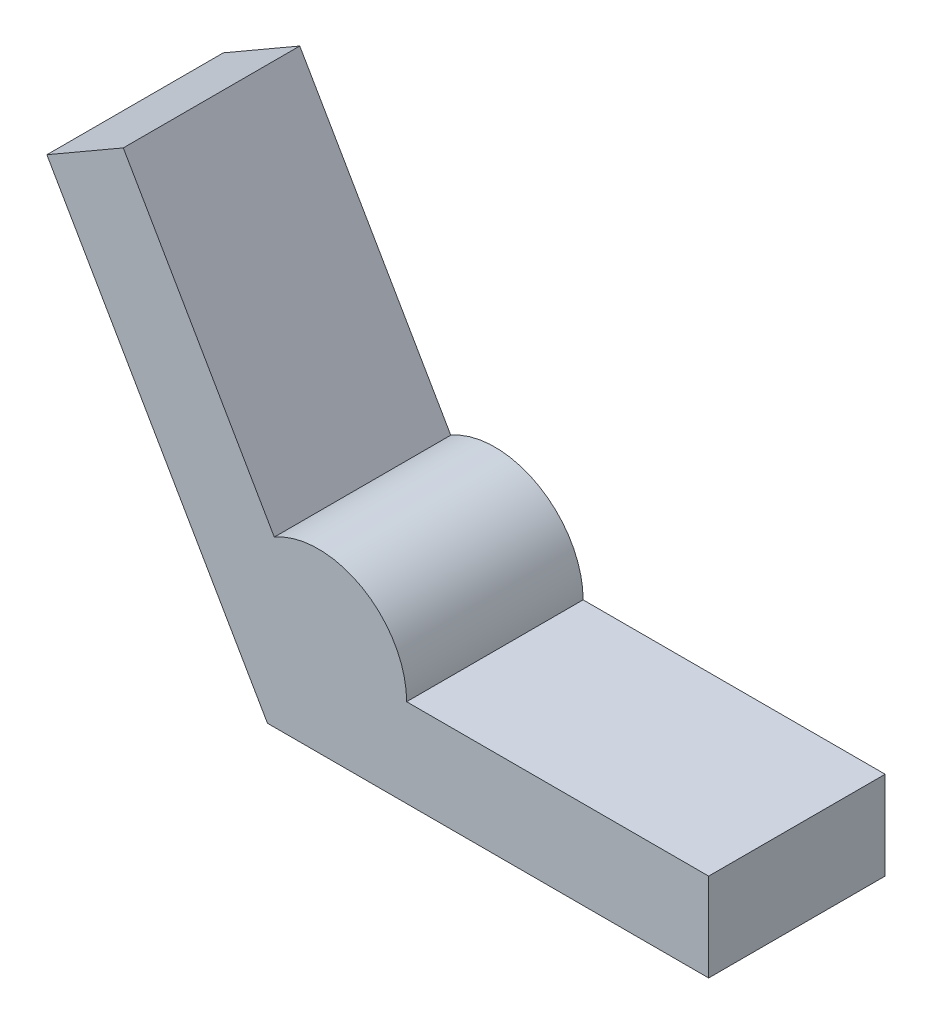
ISO-10303-21;
HEADER;
FILE_DESCRIPTION(('STEP AP214'),'2;1');
FILE_NAME('part.step','',(''),(''),'','','');
FILE_SCHEMA(('AUTOMOTIVE_DESIGN { 1 0 10303 214 1 1 1 1 }'));
ENDSEC;
DATA;
#1=APPLICATION_CONTEXT('core data for automotive mechanical design processes');
#2=APPLICATION_PROTOCOL_DEFINITION('international standard','automotive_design',2000,#1);
#3=PRODUCT_CONTEXT('',#1,'mechanical');
#4=PRODUCT('Part','Part','',(#3));
#5=PRODUCT_RELATED_PRODUCT_CATEGORY('part','',(#4));
#6=PRODUCT_DEFINITION_FORMATION('','',#4);
#7=PRODUCT_DEFINITION_CONTEXT('part definition',#1,'design');
#8=PRODUCT_DEFINITION('design','',#6,#7);
#9=PRODUCT_DEFINITION_SHAPE('','',#8);
#10=(LENGTH_UNIT() NAMED_UNIT(*) SI_UNIT(.MILLI.,.METRE.));
#11=(NAMED_UNIT(*) PLANE_ANGLE_UNIT() SI_UNIT($,.RADIAN.));
#12=(NAMED_UNIT(*) SI_UNIT($,.STERADIAN.) SOLID_ANGLE_UNIT());
#13=UNCERTAINTY_MEASURE_WITH_UNIT(LENGTH_MEASURE(1.E-05),#10,'distance_accuracy_value','');
#14=(GEOMETRIC_REPRESENTATION_CONTEXT(3) GLOBAL_UNCERTAINTY_ASSIGNED_CONTEXT((#13)) GLOBAL_UNIT_ASSIGNED_CONTEXT((#10,
#11,#12)) REPRESENTATION_CONTEXT('',''));
#15=CARTESIAN_POINT('',(0.,0.,0.));
#16=DIRECTION('',(0.,0.,1.));
#17=DIRECTION('',(1.,0.,0.));
#18=AXIS2_PLACEMENT_3D('',#15,#16,#17);
#19=CARTESIAN_POINT('',(-7.49999999999997,12.9903810567666,6.));
#20=DIRECTION('',(0.86602540378444,0.499999999999998,0.));
#21=DIRECTION('',(-0.499999999999998,0.86602540378444,0.));
#22=AXIS2_PLACEMENT_3D('',#19,#20,#21);
#23=PLANE('',#22);
#24=DIRECTION('',(0.499999999999998,-0.86602540378444,0.));
#25=VECTOR('',#24,1.);
#26=CARTESIAN_POINT('',(-7.49999999999997,12.9903810567666,0.));
#27=LINE('',#26,#25);
#28=CARTESIAN_POINT('',(-7.49999999999997,12.9903810567666,0.));
#29=VERTEX_POINT('',#28);
#30=CARTESIAN_POINT('',(0.,0.,0.));
#31=VERTEX_POINT('',#30);
#32=EDGE_CURVE('E134',#29,#31,#27,.T.);
#33=ORIENTED_EDGE('',*,*,#32,.T.);
#34=DIRECTION('',(0.,0.,-1.));
#35=VECTOR('',#34,1.);
#36=CARTESIAN_POINT('',(0.,0.,6.));
#37=LINE('',#36,#35);
#38=CARTESIAN_POINT('',(0.,0.,6.));
#39=VERTEX_POINT('',#38);
#40=EDGE_CURVE('E11',#39,#31,#37,.T.);
#41=ORIENTED_EDGE('',*,*,#40,.F.);
#42=DIRECTION('',(0.499999999999998,-0.86602540378444,0.));
#43=VECTOR('',#42,1.);
#44=CARTESIAN_POINT('',(-7.49999999999997,12.9903810567666,6.));
#45=LINE('',#44,#43);
#46=CARTESIAN_POINT('',(-7.49999999999997,12.9903810567666,6.));
#47=VERTEX_POINT('',#46);
#48=EDGE_CURVE('E153',#47,#39,#45,.T.);
#49=ORIENTED_EDGE('',*,*,#48,.F.);
#50=DIRECTION('',(0.,0.,-1.));
#51=VECTOR('',#50,1.);
#52=CARTESIAN_POINT('',(-7.49999999999997,12.9903810567666,6.));
#53=LINE('',#52,#51);
#54=EDGE_CURVE('E130',#47,#29,#53,.T.);
#55=ORIENTED_EDGE('',*,*,#54,.T.);
#56=EDGE_LOOP('',(#33,#41,#49,#55));
#57=FACE_BOUND('',#56,.T.);
#58=ADVANCED_FACE('F39',(#57),#23,.F.);
#59=CARTESIAN_POINT('',(0.,0.,6.));
#60=DIRECTION('',(0.,1.,0.));
#61=DIRECTION('',(0.,0.,1.));
#62=AXIS2_PLACEMENT_3D('',#59,#60,#61);
#63=PLANE('',#62);
#64=DIRECTION('',(1.,0.,0.));
#65=VECTOR('',#64,1.);
#66=CARTESIAN_POINT('',(0.,0.,0.));
#67=LINE('',#66,#65);
#68=CARTESIAN_POINT('',(15.,0.,0.));
#69=VERTEX_POINT('',#68);
#70=EDGE_CURVE('E138',#31,#69,#67,.T.);
#71=ORIENTED_EDGE('',*,*,#70,.T.);
#72=DIRECTION('',(0.,0.,-1.));
#73=VECTOR('',#72,1.);
#74=CARTESIAN_POINT('',(15.,0.,6.));
#75=LINE('',#74,#73);
#76=CARTESIAN_POINT('',(15.,0.,6.));
#77=VERTEX_POINT('',#76);
#78=EDGE_CURVE('E48',#77,#69,#75,.T.);
#79=ORIENTED_EDGE('',*,*,#78,.F.);
#80=DIRECTION('',(1.,0.,0.));
#81=VECTOR('',#80,1.);
#82=CARTESIAN_POINT('',(0.,0.,6.));
#83=LINE('',#82,#81);
#84=EDGE_CURVE('E96',#39,#77,#83,.T.);
#85=ORIENTED_EDGE('',*,*,#84,.F.);
#86=ORIENTED_EDGE('',*,*,#40,.T.);
#87=EDGE_LOOP('',(#71,#79,#85,#86));
#88=FACE_BOUND('',#87,.T.);
#89=ADVANCED_FACE('F187',(#88),#63,.F.);
#90=CARTESIAN_POINT('',(15.,0.,6.));
#91=DIRECTION('',(-1.,0.,0.));
#92=DIRECTION('',(0.,0.,1.));
#93=AXIS2_PLACEMENT_3D('',#90,#91,#92);
#94=PLANE('',#93);
#95=DIRECTION('',(0.,1.,0.));
#96=VECTOR('',#95,1.);
#97=CARTESIAN_POINT('',(15.,0.,0.));
#98=LINE('',#97,#96);
#99=CARTESIAN_POINT('',(15.,3.,0.));
#100=VERTEX_POINT('',#99);
#101=EDGE_CURVE('E141',#69,#100,#98,.T.);
#102=ORIENTED_EDGE('',*,*,#101,.T.);
#103=DIRECTION('',(0.,0.,-1.));
#104=VECTOR('',#103,1.);
#105=CARTESIAN_POINT('',(15.,3.,6.));
#106=LINE('',#105,#104);
#107=CARTESIAN_POINT('',(15.,3.,6.));
#108=VERTEX_POINT('',#107);
#109=EDGE_CURVE('E160',#108,#100,#106,.T.);
#110=ORIENTED_EDGE('',*,*,#109,.F.);
#111=DIRECTION('',(0.,1.,0.));
#112=VECTOR('',#111,1.);
#113=CARTESIAN_POINT('',(15.,0.,6.));
#114=LINE('',#113,#112);
#115=EDGE_CURVE('E170',#77,#108,#114,.T.);
#116=ORIENTED_EDGE('',*,*,#115,.F.);
#117=ORIENTED_EDGE('',*,*,#78,.T.);
#118=EDGE_LOOP('',(#102,#110,#116,#117));
#119=FACE_BOUND('',#118,.T.);
#120=ADVANCED_FACE('F168',(#119),#94,.F.);
#121=CARTESIAN_POINT('',(15.,3.,6.));
#122=DIRECTION('',(0.,-1.,0.));
#123=DIRECTION('',(1.,0.,0.));
#124=AXIS2_PLACEMENT_3D('',#121,#122,#123);
#125=PLANE('',#124);
#126=DIRECTION('',(-1.,0.,0.));
#127=VECTOR('',#126,1.);
#128=CARTESIAN_POINT('',(15.,3.,0.));
#129=LINE('',#128,#127);
#130=CARTESIAN_POINT('',(4.73205080756889,3.,0.));
#131=VERTEX_POINT('',#130);
#132=EDGE_CURVE('E144',#100,#131,#129,.T.);
#133=ORIENTED_EDGE('',*,*,#132,.T.);
#134=DIRECTION('',(0.,0.,-1.));
#135=VECTOR('',#134,1.);
#136=CARTESIAN_POINT('',(4.73205080756889,3.,6.));
#137=LINE('',#136,#135);
#138=CARTESIAN_POINT('',(4.73205080756889,3.,6.));
#139=VERTEX_POINT('',#138);
#140=EDGE_CURVE('E123',#139,#131,#137,.T.);
#141=ORIENTED_EDGE('',*,*,#140,.F.);
#142=DIRECTION('',(-1.,0.,0.));
#143=VECTOR('',#142,1.);
#144=CARTESIAN_POINT('',(15.,3.,6.));
#145=LINE('',#144,#143);
#146=EDGE_CURVE('E112',#108,#139,#145,.T.);
#147=ORIENTED_EDGE('',*,*,#146,.F.);
#148=ORIENTED_EDGE('',*,*,#109,.T.);
#149=EDGE_LOOP('',(#133,#141,#147,#148));
#150=FACE_BOUND('',#149,.T.);
#151=ADVANCED_FACE('F176',(#150),#125,.F.);
#152=CARTESIAN_POINT('',(1.73205080756889,3.,6.));
#153=DIRECTION('',(0.,0.,-1.));
#154=DIRECTION('',(-1.,0.,0.));
#155=AXIS2_PLACEMENT_3D('',#152,#153,#154);
#156=CYLINDRICAL_SURFACE('',#155,3.);
#157=CARTESIAN_POINT('',(1.73205080756889,3.,0.));
#158=DIRECTION('',(0.,0.,1.));
#159=DIRECTION('',(1.,0.,0.));
#160=AXIS2_PLACEMENT_3D('',#157,#158,#159);
#161=CIRCLE('',#160,3.);
#162=CARTESIAN_POINT('',(0.232050807568891,5.59807621135332,0.));
#163=VERTEX_POINT('',#162);
#164=EDGE_CURVE('E121',#131,#163,#161,.T.);
#165=ORIENTED_EDGE('',*,*,#164,.T.);
#166=DIRECTION('',(0.,0.,-1.));
#167=VECTOR('',#166,1.);
#168=CARTESIAN_POINT('',(0.232050807568891,5.59807621135332,6.));
#169=LINE('',#168,#167);
#170=CARTESIAN_POINT('',(0.232050807568891,5.59807621135332,6.));
#171=VERTEX_POINT('',#170);
#172=EDGE_CURVE('E118',#171,#163,#169,.T.);
#173=ORIENTED_EDGE('',*,*,#172,.F.);
#174=CARTESIAN_POINT('',(1.73205080756889,3.,6.));
#175=DIRECTION('',(0.,0.,1.));
#176=DIRECTION('',(1.,0.,0.));
#177=AXIS2_PLACEMENT_3D('',#174,#175,#176);
#178=CIRCLE('',#177,3.);
#179=EDGE_CURVE('E106',#139,#171,#178,.T.);
#180=ORIENTED_EDGE('',*,*,#179,.F.);
#181=ORIENTED_EDGE('',*,*,#140,.T.);
#182=EDGE_LOOP('',(#165,#173,#180,#181));
#183=FACE_BOUND('',#182,.T.);
#184=ADVANCED_FACE('F119',(#183),#156,.T.);
#185=CARTESIAN_POINT('',(0.232050807568891,5.59807621135332,6.));
#186=DIRECTION('',(-0.86602540378444,-0.499999999999998,0.));
#187=DIRECTION('',(0.499999999999998,-0.86602540378444,0.));
#188=AXIS2_PLACEMENT_3D('',#185,#186,#187);
#189=PLANE('',#188);
#190=DIRECTION('',(-0.499999999999998,0.86602540378444,0.));
#191=VECTOR('',#190,1.);
#192=CARTESIAN_POINT('',(0.232050807568891,5.59807621135332,0.));
#193=LINE('',#192,#191);
#194=CARTESIAN_POINT('',(-4.90192378864665,14.4903810567666,0.));
#195=VERTEX_POINT('',#194);
#196=EDGE_CURVE('E82',#163,#195,#193,.T.);
#197=ORIENTED_EDGE('',*,*,#196,.T.);
#198=DIRECTION('',(0.,0.,-1.));
#199=VECTOR('',#198,1.);
#200=CARTESIAN_POINT('',(-4.90192378864665,14.4903810567666,6.));
#201=LINE('',#200,#199);
#202=CARTESIAN_POINT('',(-4.90192378864665,14.4903810567666,6.));
#203=VERTEX_POINT('',#202);
#204=EDGE_CURVE('E124',#203,#195,#201,.T.);
#205=ORIENTED_EDGE('',*,*,#204,.F.);
#206=DIRECTION('',(-0.499999999999998,0.86602540378444,0.));
#207=VECTOR('',#206,1.);
#208=CARTESIAN_POINT('',(0.232050807568891,5.59807621135332,6.));
#209=LINE('',#208,#207);
#210=EDGE_CURVE('E110',#171,#203,#209,.T.);
#211=ORIENTED_EDGE('',*,*,#210,.F.);
#212=ORIENTED_EDGE('',*,*,#172,.T.);
#213=EDGE_LOOP('',(#197,#205,#211,#212));
#214=FACE_BOUND('',#213,.T.);
#215=ADVANCED_FACE('F126',(#214),#189,.F.);
#216=CARTESIAN_POINT('',(-4.90192378864665,14.4903810567666,6.));
#217=DIRECTION('',(0.499999999999998,-0.86602540378444,0.));
#218=DIRECTION('',(0.86602540378444,0.499999999999998,0.));
#219=AXIS2_PLACEMENT_3D('',#216,#217,#218);
#220=PLANE('',#219);
#221=DIRECTION('',(-0.86602540378444,-0.499999999999998,0.));
#222=VECTOR('',#221,1.);
#223=CARTESIAN_POINT('',(-4.90192378864665,14.4903810567666,0.));
#224=LINE('',#223,#222);
#225=EDGE_CURVE('E88',#195,#29,#224,.T.);
#226=ORIENTED_EDGE('',*,*,#225,.T.);
#227=ORIENTED_EDGE('',*,*,#54,.F.);
#228=DIRECTION('',(-0.86602540378444,-0.499999999999998,0.));
#229=VECTOR('',#228,1.);
#230=CARTESIAN_POINT('',(-4.90192378864665,14.4903810567666,6.));
#231=LINE('',#230,#229);
#232=EDGE_CURVE('E56',#203,#47,#231,.T.);
#233=ORIENTED_EDGE('',*,*,#232,.F.);
#234=ORIENTED_EDGE('',*,*,#204,.T.);
#235=EDGE_LOOP('',(#226,#227,#233,#234));
#236=FACE_BOUND('',#235,.T.);
#237=ADVANCED_FACE('F201',(#236),#220,.F.);
#238=CARTESIAN_POINT('',(1.73205080756889,3.,6.));
#239=DIRECTION('',(0.,0.,1.));
#240=DIRECTION('',(1.,0.,0.));
#241=AXIS2_PLACEMENT_3D('',#238,#239,#240);
#242=PLANE('',#241);
#243=ORIENTED_EDGE('',*,*,#48,.T.);
#244=ORIENTED_EDGE('',*,*,#84,.T.);
#245=ORIENTED_EDGE('',*,*,#115,.T.);
#246=ORIENTED_EDGE('',*,*,#146,.T.);
#247=ORIENTED_EDGE('',*,*,#179,.T.);
#248=ORIENTED_EDGE('',*,*,#210,.T.);
#249=ORIENTED_EDGE('',*,*,#232,.T.);
#250=EDGE_LOOP('',(#243,#244,#245,#246,#247,#248,#249));
#251=FACE_BOUND('',#250,.T.);
#252=ADVANCED_FACE('F108',(#251),#242,.T.);
#253=CARTESIAN_POINT('',(1.73205080756889,3.,0.));
#254=DIRECTION('',(0.,0.,1.));
#255=DIRECTION('',(1.,0.,0.));
#256=AXIS2_PLACEMENT_3D('',#253,#254,#255);
#257=PLANE('',#256);
#258=ORIENTED_EDGE('',*,*,#32,.F.);
#259=ORIENTED_EDGE('',*,*,#225,.F.);
#260=ORIENTED_EDGE('',*,*,#196,.F.);
#261=ORIENTED_EDGE('',*,*,#164,.F.);
#262=ORIENTED_EDGE('',*,*,#132,.F.);
#263=ORIENTED_EDGE('',*,*,#101,.F.);
#264=ORIENTED_EDGE('',*,*,#70,.F.);
#265=EDGE_LOOP('',(#258,#259,#260,#261,#262,#263,#264));
#266=FACE_BOUND('',#265,.T.);
#267=ADVANCED_FACE('F174',(#266),#257,.F.);
#268=CLOSED_SHELL('',(#58,#89,#120,#151,#184,#215,#237,#252,#267));
#269=MANIFOLD_SOLID_BREP('B2',#268);
#270=ADVANCED_BREP_SHAPE_REPRESENTATION('',(#18,#269),#14);
#271=SHAPE_DEFINITION_REPRESENTATION(#9,#270);
ENDSEC;
END-ISO-10303-21;
